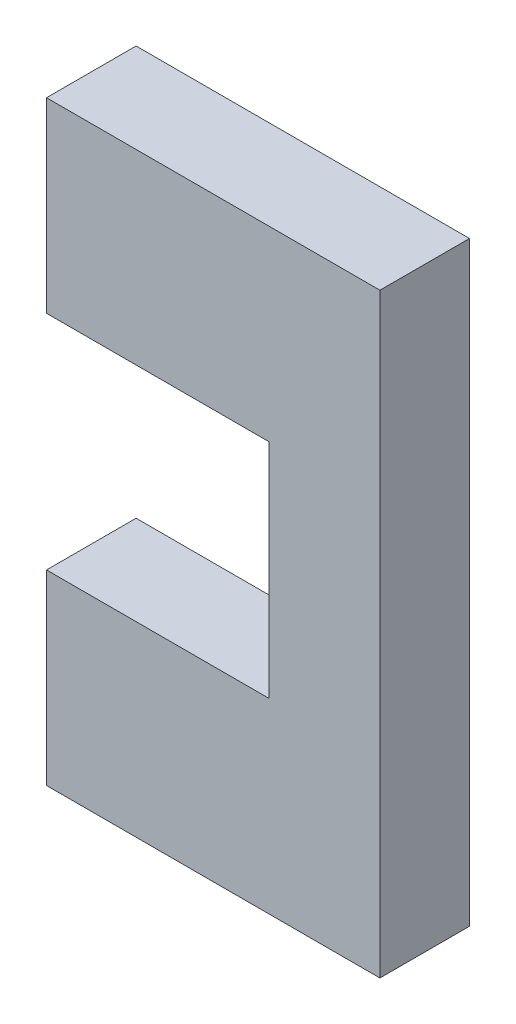
ISO-10303-21;
HEADER;
FILE_DESCRIPTION(('STEP AP214'),'2;1');
FILE_NAME('part.step','',(''),(''),'','','');
FILE_SCHEMA(('AUTOMOTIVE_DESIGN { 1 0 10303 214 1 1 1 1 }'));
ENDSEC;
DATA;
#1=APPLICATION_CONTEXT('core data for automotive mechanical design processes');
#2=APPLICATION_PROTOCOL_DEFINITION('international standard','automotive_design',2000,#1);
#3=PRODUCT_CONTEXT('',#1,'mechanical');
#4=PRODUCT('Part','Part','',(#3));
#5=PRODUCT_RELATED_PRODUCT_CATEGORY('part','',(#4));
#6=PRODUCT_DEFINITION_FORMATION('','',#4);
#7=PRODUCT_DEFINITION_CONTEXT('part definition',#1,'design');
#8=PRODUCT_DEFINITION('design','',#6,#7);
#9=PRODUCT_DEFINITION_SHAPE('','',#8);
#10=(LENGTH_UNIT() NAMED_UNIT(*) SI_UNIT(.MILLI.,.METRE.));
#11=(NAMED_UNIT(*) PLANE_ANGLE_UNIT() SI_UNIT($,.RADIAN.));
#12=(NAMED_UNIT(*) SI_UNIT($,.STERADIAN.) SOLID_ANGLE_UNIT());
#13=UNCERTAINTY_MEASURE_WITH_UNIT(LENGTH_MEASURE(1.E-05),#10,'distance_accuracy_value','');
#14=(GEOMETRIC_REPRESENTATION_CONTEXT(3) GLOBAL_UNCERTAINTY_ASSIGNED_CONTEXT((#13)) GLOBAL_UNIT_ASSIGNED_CONTEXT((#10,
#11,#12)) REPRESENTATION_CONTEXT('',''));
#15=CARTESIAN_POINT('',(0.,0.,0.));
#16=DIRECTION('',(0.,0.,1.));
#17=DIRECTION('',(1.,0.,0.));
#18=AXIS2_PLACEMENT_3D('',#15,#16,#17);
#19=CARTESIAN_POINT('',(76.2,215.218,88.2461751827283));
#20=DIRECTION('',(0.,-1.,0.));
#21=DIRECTION('',(1.,0.,0.));
#22=AXIS2_PLACEMENT_3D('',#19,#20,#21);
#23=PLANE('',#22);
#24=DIRECTION('',(-1.,0.,0.));
#25=VECTOR('',#24,1.);
#26=CARTESIAN_POINT('',(76.2000000000001,215.218,10.237155294));
#27=LINE('',#26,#25);
#28=CARTESIAN_POINT('',(76.2,215.218,10.237155294));
#29=VERTEX_POINT('',#28);
#30=CARTESIAN_POINT('',(38.1,215.218,10.2371552939999));
#31=VERTEX_POINT('',#30);
#32=EDGE_CURVE('E132',#29,#31,#27,.T.);
#33=ORIENTED_EDGE('',*,*,#32,.F.);
#34=DIRECTION('',(0.,0.,-1.));
#35=VECTOR('',#34,1.);
#36=CARTESIAN_POINT('',(76.2,215.218,88.2461751827283));
#37=LINE('',#36,#35);
#38=CARTESIAN_POINT('',(76.2,215.218,0.));
#39=VERTEX_POINT('',#38);
#40=EDGE_CURVE('E37',#29,#39,#37,.T.);
#41=ORIENTED_EDGE('',*,*,#40,.T.);
#42=DIRECTION('',(-1.,0.,0.));
#43=VECTOR('',#42,1.);
#44=CARTESIAN_POINT('',(76.2,215.218,0.));
#45=LINE('',#44,#43);
#46=CARTESIAN_POINT('',(38.1,215.218,0.));
#47=VERTEX_POINT('',#46);
#48=EDGE_CURVE('E140',#39,#47,#45,.T.);
#49=ORIENTED_EDGE('',*,*,#48,.T.);
#50=DIRECTION('',(0.,0.,-1.));
#51=VECTOR('',#50,1.);
#52=CARTESIAN_POINT('',(38.1,215.218,88.2461751827283));
#53=LINE('',#52,#51);
#54=EDGE_CURVE('E88',#31,#47,#53,.T.);
#55=ORIENTED_EDGE('',*,*,#54,.F.);
#56=EDGE_LOOP('',(#33,#41,#49,#55));
#57=FACE_BOUND('',#56,.T.);
#58=ADVANCED_FACE('F33',(#57),#23,.F.);
#59=CARTESIAN_POINT('',(38.1,215.218,88.2461751827283));
#60=DIRECTION('',(1.,0.,0.));
#61=DIRECTION('',(0.,1.,0.));
#62=AXIS2_PLACEMENT_3D('',#59,#60,#61);
#63=PLANE('',#62);
#64=DIRECTION('',(0.,-1.,0.));
#65=VECTOR('',#64,1.);
#66=CARTESIAN_POINT('',(38.1,215.218,10.2371552939999));
#67=LINE('',#66,#65);
#68=CARTESIAN_POINT('',(38.1,193.882,10.237155294));
#69=VERTEX_POINT('',#68);
#70=EDGE_CURVE('E95',#31,#69,#67,.T.);
#71=ORIENTED_EDGE('',*,*,#70,.F.);
#72=ORIENTED_EDGE('',*,*,#54,.T.);
#73=DIRECTION('',(0.,-1.,0.));
#74=VECTOR('',#73,1.);
#75=CARTESIAN_POINT('',(38.1,215.218,0.));
#76=LINE('',#75,#74);
#77=CARTESIAN_POINT('',(38.1,193.882,0.));
#78=VERTEX_POINT('',#77);
#79=EDGE_CURVE('E139',#47,#78,#76,.T.);
#80=ORIENTED_EDGE('',*,*,#79,.T.);
#81=DIRECTION('',(0.,0.,-1.));
#82=VECTOR('',#81,1.);
#83=CARTESIAN_POINT('',(38.1,193.882,88.2461751827283));
#84=LINE('',#83,#82);
#85=EDGE_CURVE('E141',#69,#78,#84,.T.);
#86=ORIENTED_EDGE('',*,*,#85,.F.);
#87=EDGE_LOOP('',(#71,#72,#80,#86));
#88=FACE_BOUND('',#87,.T.);
#89=ADVANCED_FACE('F170',(#88),#63,.F.);
#90=CARTESIAN_POINT('',(38.1,193.882,88.2461751827283));
#91=DIRECTION('',(0.,1.,0.));
#92=DIRECTION('',(-1.,0.,0.));
#93=AXIS2_PLACEMENT_3D('',#90,#91,#92);
#94=PLANE('',#93);
#95=DIRECTION('',(1.,0.,0.));
#96=VECTOR('',#95,1.);
#97=CARTESIAN_POINT('',(38.1000000000001,193.882,10.2371552939999));
#98=LINE('',#97,#96);
#99=CARTESIAN_POINT('',(63.5,193.882,10.237155294));
#100=VERTEX_POINT('',#99);
#101=EDGE_CURVE('E128',#69,#100,#98,.T.);
#102=ORIENTED_EDGE('',*,*,#101,.F.);
#103=ORIENTED_EDGE('',*,*,#85,.T.);
#104=DIRECTION('',(1.,0.,0.));
#105=VECTOR('',#104,1.);
#106=CARTESIAN_POINT('',(38.1,193.882,0.));
#107=LINE('',#106,#105);
#108=CARTESIAN_POINT('',(63.5,193.882,0.));
#109=VERTEX_POINT('',#108);
#110=EDGE_CURVE('E143',#78,#109,#107,.T.);
#111=ORIENTED_EDGE('',*,*,#110,.T.);
#112=DIRECTION('',(0.,0.,-1.));
#113=VECTOR('',#112,1.);
#114=CARTESIAN_POINT('',(63.5,193.882,88.2461751827283));
#115=LINE('',#114,#113);
#116=EDGE_CURVE('E144',#100,#109,#115,.T.);
#117=ORIENTED_EDGE('',*,*,#116,.F.);
#118=EDGE_LOOP('',(#102,#103,#111,#117));
#119=FACE_BOUND('',#118,.T.);
#120=ADVANCED_FACE('F173',(#119),#94,.F.);
#121=CARTESIAN_POINT('',(63.5,193.882,88.2461751827283));
#122=DIRECTION('',(1.,0.,0.));
#123=DIRECTION('',(0.,1.,0.));
#124=AXIS2_PLACEMENT_3D('',#121,#122,#123);
#125=PLANE('',#124);
#126=DIRECTION('',(0.,-1.,0.));
#127=VECTOR('',#126,1.);
#128=CARTESIAN_POINT('',(63.5,193.882,10.237155294));
#129=LINE('',#128,#127);
#130=CARTESIAN_POINT('',(63.5,168.482,10.237155294));
#131=VERTEX_POINT('',#130);
#132=EDGE_CURVE('E123',#100,#131,#129,.T.);
#133=ORIENTED_EDGE('',*,*,#132,.F.);
#134=ORIENTED_EDGE('',*,*,#116,.T.);
#135=DIRECTION('',(0.,-1.,0.));
#136=VECTOR('',#135,1.);
#137=CARTESIAN_POINT('',(63.5,193.882,0.));
#138=LINE('',#137,#136);
#139=CARTESIAN_POINT('',(63.5,168.482,0.));
#140=VERTEX_POINT('',#139);
#141=EDGE_CURVE('E146',#109,#140,#138,.T.);
#142=ORIENTED_EDGE('',*,*,#141,.T.);
#143=DIRECTION('',(0.,0.,-1.));
#144=VECTOR('',#143,1.);
#145=CARTESIAN_POINT('',(63.5,168.482,88.2461751827283));
#146=LINE('',#145,#144);
#147=EDGE_CURVE('E147',#131,#140,#146,.T.);
#148=ORIENTED_EDGE('',*,*,#147,.F.);
#149=EDGE_LOOP('',(#133,#134,#142,#148));
#150=FACE_BOUND('',#149,.T.);
#151=ADVANCED_FACE('F175',(#150),#125,.F.);
#152=CARTESIAN_POINT('',(63.5,168.482,88.2461751827283));
#153=DIRECTION('',(0.,-1.,0.));
#154=DIRECTION('',(1.,0.,0.));
#155=AXIS2_PLACEMENT_3D('',#152,#153,#154);
#156=PLANE('',#155);
#157=DIRECTION('',(-1.,0.,0.));
#158=VECTOR('',#157,1.);
#159=CARTESIAN_POINT('',(63.5000000000001,168.482,10.237155294));
#160=LINE('',#159,#158);
#161=CARTESIAN_POINT('',(38.1,168.482,10.2371552939999));
#162=VERTEX_POINT('',#161);
#163=EDGE_CURVE('E121',#131,#162,#160,.T.);
#164=ORIENTED_EDGE('',*,*,#163,.F.);
#165=ORIENTED_EDGE('',*,*,#147,.T.);
#166=DIRECTION('',(-1.,0.,0.));
#167=VECTOR('',#166,1.);
#168=CARTESIAN_POINT('',(63.5,168.482,0.));
#169=LINE('',#168,#167);
#170=CARTESIAN_POINT('',(38.1,168.482,0.));
#171=VERTEX_POINT('',#170);
#172=EDGE_CURVE('E149',#140,#171,#169,.T.);
#173=ORIENTED_EDGE('',*,*,#172,.T.);
#174=DIRECTION('',(0.,0.,-1.));
#175=VECTOR('',#174,1.);
#176=CARTESIAN_POINT('',(38.1,168.482,88.2461751827283));
#177=LINE('',#176,#175);
#178=EDGE_CURVE('E150',#162,#171,#177,.T.);
#179=ORIENTED_EDGE('',*,*,#178,.F.);
#180=EDGE_LOOP('',(#164,#165,#173,#179));
#181=FACE_BOUND('',#180,.T.);
#182=ADVANCED_FACE('F179',(#181),#156,.F.);
#183=CARTESIAN_POINT('',(38.1,168.482,88.2461751827283));
#184=DIRECTION('',(1.,0.,0.));
#185=DIRECTION('',(0.,0.,-1.));
#186=AXIS2_PLACEMENT_3D('',#183,#184,#185);
#187=PLANE('',#186);
#188=DIRECTION('',(0.,-1.,0.));
#189=VECTOR('',#188,1.);
#190=CARTESIAN_POINT('',(38.1,168.482,10.2371552939999));
#191=LINE('',#190,#189);
#192=CARTESIAN_POINT('',(38.1,147.146,10.237155294));
#193=VERTEX_POINT('',#192);
#194=EDGE_CURVE('E42',#162,#193,#191,.T.);
#195=ORIENTED_EDGE('',*,*,#194,.F.);
#196=ORIENTED_EDGE('',*,*,#178,.T.);
#197=DIRECTION('',(0.,-1.,0.));
#198=VECTOR('',#197,1.);
#199=CARTESIAN_POINT('',(38.1,168.482,0.));
#200=LINE('',#199,#198);
#201=CARTESIAN_POINT('',(38.1,147.146,0.));
#202=VERTEX_POINT('',#201);
#203=EDGE_CURVE('E115',#171,#202,#200,.T.);
#204=ORIENTED_EDGE('',*,*,#203,.T.);
#205=DIRECTION('',(0.,0.,-1.));
#206=VECTOR('',#205,1.);
#207=CARTESIAN_POINT('',(38.1,147.146,88.2461751827283));
#208=LINE('',#207,#206);
#209=EDGE_CURVE('E106',#193,#202,#208,.T.);
#210=ORIENTED_EDGE('',*,*,#209,.F.);
#211=EDGE_LOOP('',(#195,#196,#204,#210));
#212=FACE_BOUND('',#211,.T.);
#213=ADVANCED_FACE('F112',(#212),#187,.F.);
#214=CARTESIAN_POINT('',(38.1,147.146,88.2461751827283));
#215=DIRECTION('',(0.,1.,0.));
#216=DIRECTION('',(0.,0.,1.));
#217=AXIS2_PLACEMENT_3D('',#214,#215,#216);
#218=PLANE('',#217);
#219=DIRECTION('',(1.,0.,0.));
#220=VECTOR('',#219,1.);
#221=CARTESIAN_POINT('',(38.1000000000001,147.146,10.237155294));
#222=LINE('',#221,#220);
#223=CARTESIAN_POINT('',(76.2,147.146,10.237155294));
#224=VERTEX_POINT('',#223);
#225=EDGE_CURVE('E11',#193,#224,#222,.T.);
#226=ORIENTED_EDGE('',*,*,#225,.F.);
#227=ORIENTED_EDGE('',*,*,#209,.T.);
#228=DIRECTION('',(1.,0.,0.));
#229=VECTOR('',#228,1.);
#230=CARTESIAN_POINT('',(38.1,147.146,0.));
#231=LINE('',#230,#229);
#232=CARTESIAN_POINT('',(76.2,147.146,0.));
#233=VERTEX_POINT('',#232);
#234=EDGE_CURVE('E117',#202,#233,#231,.T.);
#235=ORIENTED_EDGE('',*,*,#234,.T.);
#236=DIRECTION('',(0.,0.,-1.));
#237=VECTOR('',#236,1.);
#238=CARTESIAN_POINT('',(76.2,147.146,88.2461751827283));
#239=LINE('',#238,#237);
#240=EDGE_CURVE('E55',#224,#233,#239,.T.);
#241=ORIENTED_EDGE('',*,*,#240,.F.);
#242=EDGE_LOOP('',(#226,#227,#235,#241));
#243=FACE_BOUND('',#242,.T.);
#244=ADVANCED_FACE('F105',(#243),#218,.F.);
#245=CARTESIAN_POINT('',(76.2,147.146,88.2461751827283));
#246=DIRECTION('',(-1.,0.,0.));
#247=DIRECTION('',(0.,0.,1.));
#248=AXIS2_PLACEMENT_3D('',#245,#246,#247);
#249=PLANE('',#248);
#250=DIRECTION('',(0.,1.,0.));
#251=VECTOR('',#250,1.);
#252=CARTESIAN_POINT('',(76.2,147.146,10.237155294));
#253=LINE('',#252,#251);
#254=EDGE_CURVE('E135',#224,#29,#253,.T.);
#255=ORIENTED_EDGE('',*,*,#254,.F.);
#256=ORIENTED_EDGE('',*,*,#240,.T.);
#257=DIRECTION('',(0.,1.,0.));
#258=VECTOR('',#257,1.);
#259=CARTESIAN_POINT('',(76.2,147.146,0.));
#260=LINE('',#259,#258);
#261=EDGE_CURVE('E137',#233,#39,#260,.T.);
#262=ORIENTED_EDGE('',*,*,#261,.T.);
#263=ORIENTED_EDGE('',*,*,#40,.F.);
#264=EDGE_LOOP('',(#255,#256,#262,#263));
#265=FACE_BOUND('',#264,.T.);
#266=ADVANCED_FACE('F165',(#265),#249,.F.);
#267=CARTESIAN_POINT('',(0.,0.,0.));
#268=DIRECTION('',(0.,0.,1.));
#269=DIRECTION('',(1.,0.,0.));
#270=AXIS2_PLACEMENT_3D('',#267,#268,#269);
#271=PLANE('',#270);
#272=ORIENTED_EDGE('',*,*,#48,.F.);
#273=ORIENTED_EDGE('',*,*,#261,.F.);
#274=ORIENTED_EDGE('',*,*,#234,.F.);
#275=ORIENTED_EDGE('',*,*,#203,.F.);
#276=ORIENTED_EDGE('',*,*,#172,.F.);
#277=ORIENTED_EDGE('',*,*,#141,.F.);
#278=ORIENTED_EDGE('',*,*,#110,.F.);
#279=ORIENTED_EDGE('',*,*,#79,.F.);
#280=EDGE_LOOP('',(#272,#273,#274,#275,#276,#277,#278,#279));
#281=FACE_BOUND('',#280,.T.);
#282=ADVANCED_FACE('F167',(#281),#271,.F.);
#283=CARTESIAN_POINT('',(38.3031999999999,82.2490000000001,10.237155294));
#284=DIRECTION('',(0.,0.,1.));
#285=DIRECTION('',(0.,1.,0.));
#286=AXIS2_PLACEMENT_3D('',#283,#284,#285);
#287=PLANE('',#286);
#288=ORIENTED_EDGE('',*,*,#254,.T.);
#289=ORIENTED_EDGE('',*,*,#32,.T.);
#290=ORIENTED_EDGE('',*,*,#70,.T.);
#291=ORIENTED_EDGE('',*,*,#101,.T.);
#292=ORIENTED_EDGE('',*,*,#132,.T.);
#293=ORIENTED_EDGE('',*,*,#163,.T.);
#294=ORIENTED_EDGE('',*,*,#194,.T.);
#295=ORIENTED_EDGE('',*,*,#225,.T.);
#296=EDGE_LOOP('',(#288,#289,#290,#291,#292,#293,#294,#295));
#297=FACE_BOUND('',#296,.T.);
#298=ADVANCED_FACE('F35',(#297),#287,.T.);
#299=CLOSED_SHELL('',(#58,#89,#120,#151,#182,#213,#244,#266,#282,#298));
#300=MANIFOLD_SOLID_BREP('B2',#299);
#301=ADVANCED_BREP_SHAPE_REPRESENTATION('',(#18,#300),#14);
#302=SHAPE_DEFINITION_REPRESENTATION(#9,#301);
ENDSEC;
END-ISO-10303-21;
